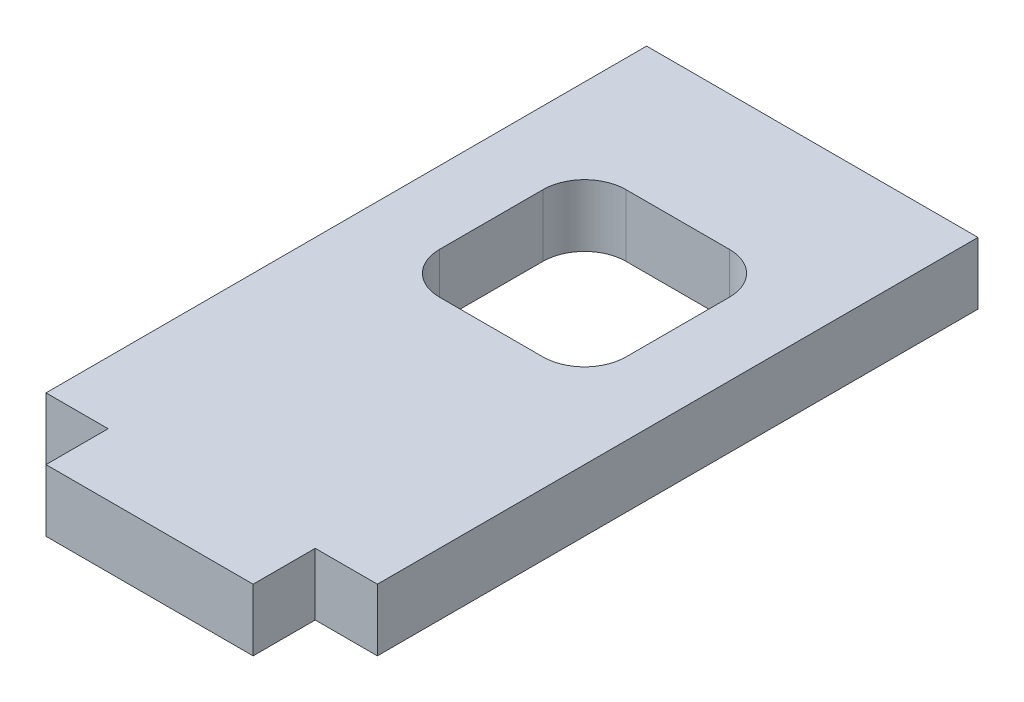
ISO-10303-21;
HEADER;
FILE_DESCRIPTION(('STEP AP214'),'2;1');
FILE_NAME('part.step','',(''),(''),'','','');
FILE_SCHEMA(('AUTOMOTIVE_DESIGN { 1 0 10303 214 1 1 1 1 }'));
ENDSEC;
DATA;
#1=APPLICATION_CONTEXT('core data for automotive mechanical design processes');
#2=APPLICATION_PROTOCOL_DEFINITION('international standard','automotive_design',2000,#1);
#3=PRODUCT_CONTEXT('',#1,'mechanical');
#4=PRODUCT('Part','Part','',(#3));
#5=PRODUCT_RELATED_PRODUCT_CATEGORY('part','',(#4));
#6=PRODUCT_DEFINITION_FORMATION('','',#4);
#7=PRODUCT_DEFINITION_CONTEXT('part definition',#1,'design');
#8=PRODUCT_DEFINITION('design','',#6,#7);
#9=PRODUCT_DEFINITION_SHAPE('','',#8);
#10=(LENGTH_UNIT() NAMED_UNIT(*) SI_UNIT(.MILLI.,.METRE.));
#11=(NAMED_UNIT(*) PLANE_ANGLE_UNIT() SI_UNIT($,.RADIAN.));
#12=(NAMED_UNIT(*) SI_UNIT($,.STERADIAN.) SOLID_ANGLE_UNIT());
#13=UNCERTAINTY_MEASURE_WITH_UNIT(LENGTH_MEASURE(1.E-05),#10,'distance_accuracy_value','');
#14=(GEOMETRIC_REPRESENTATION_CONTEXT(3) GLOBAL_UNCERTAINTY_ASSIGNED_CONTEXT((#13)) GLOBAL_UNIT_ASSIGNED_CONTEXT((#10,
#11,#12)) REPRESENTATION_CONTEXT('',''));
#15=CARTESIAN_POINT('',(0.,0.,0.));
#16=DIRECTION('',(0.,0.,1.));
#17=DIRECTION('',(1.,0.,0.));
#18=AXIS2_PLACEMENT_3D('',#15,#16,#17);
#19=CARTESIAN_POINT('',(-8.,1.5,14.5));
#20=DIRECTION('',(0.,0.,-1.));
#21=DIRECTION('',(-1.,0.,0.));
#22=AXIS2_PLACEMENT_3D('',#19,#20,#21);
#23=PLANE('',#22);
#24=DIRECTION('',(0.,-1.,0.));
#25=VECTOR('',#24,1.);
#26=CARTESIAN_POINT('',(-5.,1.5,14.5));
#27=LINE('',#26,#25);
#28=CARTESIAN_POINT('',(-5.,1.5,14.5));
#29=VERTEX_POINT('',#28);
#30=CARTESIAN_POINT('',(-5.,-1.5,14.5));
#31=VERTEX_POINT('',#30);
#32=EDGE_CURVE('E291',#29,#31,#27,.T.);
#33=ORIENTED_EDGE('',*,*,#32,.F.);
#34=DIRECTION('',(1.,0.,0.));
#35=VECTOR('',#34,1.);
#36=CARTESIAN_POINT('',(-8.,1.5,14.5));
#37=LINE('',#36,#35);
#38=CARTESIAN_POINT('',(-8.,1.5,14.5));
#39=VERTEX_POINT('',#38);
#40=EDGE_CURVE('E162',#39,#29,#37,.T.);
#41=ORIENTED_EDGE('',*,*,#40,.F.);
#42=DIRECTION('',(0.,-1.,0.));
#43=VECTOR('',#42,1.);
#44=CARTESIAN_POINT('',(-8.,1.5,14.5));
#45=LINE('',#44,#43);
#46=CARTESIAN_POINT('',(-8.,-1.5,14.5));
#47=VERTEX_POINT('',#46);
#48=EDGE_CURVE('E203',#39,#47,#45,.T.);
#49=ORIENTED_EDGE('',*,*,#48,.T.);
#50=DIRECTION('',(1.,0.,0.));
#51=VECTOR('',#50,1.);
#52=CARTESIAN_POINT('',(-8.,-1.5,14.5));
#53=LINE('',#52,#51);
#54=EDGE_CURVE('E189',#47,#31,#53,.T.);
#55=ORIENTED_EDGE('',*,*,#54,.T.);
#56=EDGE_LOOP('',(#33,#41,#49,#55));
#57=FACE_BOUND('',#56,.T.);
#58=ADVANCED_FACE('F33',(#57),#23,.F.);
#59=CARTESIAN_POINT('',(-8.,1.5,-14.5));
#60=DIRECTION('',(1.,0.,0.));
#61=DIRECTION('',(0.,0.,-1.));
#62=AXIS2_PLACEMENT_3D('',#59,#60,#61);
#63=PLANE('',#62);
#64=DIRECTION('',(0.,0.,1.));
#65=VECTOR('',#64,1.);
#66=CARTESIAN_POINT('',(-8.,-1.5,-14.5));
#67=LINE('',#66,#65);
#68=CARTESIAN_POINT('',(-8.,-1.5,-14.5));
#69=VERTEX_POINT('',#68);
#70=EDGE_CURVE('E170',#69,#47,#67,.T.);
#71=ORIENTED_EDGE('',*,*,#70,.T.);
#72=ORIENTED_EDGE('',*,*,#48,.F.);
#73=DIRECTION('',(0.,0.,1.));
#74=VECTOR('',#73,1.);
#75=CARTESIAN_POINT('',(-8.,1.5,-14.5));
#76=LINE('',#75,#74);
#77=CARTESIAN_POINT('',(-8.,1.5,-14.5));
#78=VERTEX_POINT('',#77);
#79=EDGE_CURVE('E179',#78,#39,#76,.T.);
#80=ORIENTED_EDGE('',*,*,#79,.F.);
#81=DIRECTION('',(0.,-1.,0.));
#82=VECTOR('',#81,1.);
#83=CARTESIAN_POINT('',(-8.,1.5,-14.5));
#84=LINE('',#83,#82);
#85=EDGE_CURVE('E187',#78,#69,#84,.T.);
#86=ORIENTED_EDGE('',*,*,#85,.T.);
#87=EDGE_LOOP('',(#71,#72,#80,#86));
#88=FACE_BOUND('',#87,.T.);
#89=ADVANCED_FACE('F265',(#88),#63,.F.);
#90=CARTESIAN_POINT('',(5.,1.5,14.5));
#91=VERTEX_POINT('',#90);
#92=CARTESIAN_POINT('',(8.,1.5,14.5));
#93=VERTEX_POINT('',#92);
#94=EDGE_CURVE('E181',#91,#93,#37,.T.);
#95=ORIENTED_EDGE('',*,*,#94,.F.);
#96=DIRECTION('',(0.,-1.,0.));
#97=VECTOR('',#96,1.);
#98=CARTESIAN_POINT('',(5.,1.5,14.5));
#99=LINE('',#98,#97);
#100=CARTESIAN_POINT('',(5.,-1.5,14.5));
#101=VERTEX_POINT('',#100);
#102=EDGE_CURVE('E175',#91,#101,#99,.T.);
#103=ORIENTED_EDGE('',*,*,#102,.T.);
#104=CARTESIAN_POINT('',(8.,-1.5,14.5));
#105=VERTEX_POINT('',#104);
#106=EDGE_CURVE('E173',#101,#105,#53,.T.);
#107=ORIENTED_EDGE('',*,*,#106,.T.);
#108=DIRECTION('',(0.,-1.,0.));
#109=VECTOR('',#108,1.);
#110=CARTESIAN_POINT('',(8.,1.5,14.5));
#111=LINE('',#110,#109);
#112=EDGE_CURVE('E200',#93,#105,#111,.T.);
#113=ORIENTED_EDGE('',*,*,#112,.F.);
#114=EDGE_LOOP('',(#95,#103,#107,#113));
#115=FACE_BOUND('',#114,.T.);
#116=ADVANCED_FACE('F268',(#115),#23,.F.);
#117=CARTESIAN_POINT('',(8.,1.5,-14.5));
#118=DIRECTION('',(-1.,0.,0.));
#119=DIRECTION('',(0.,0.,1.));
#120=AXIS2_PLACEMENT_3D('',#117,#118,#119);
#121=PLANE('',#120);
#122=DIRECTION('',(0.,0.,-1.));
#123=VECTOR('',#122,1.);
#124=CARTESIAN_POINT('',(8.,-1.5,-14.5));
#125=LINE('',#124,#123);
#126=CARTESIAN_POINT('',(8.,-1.5,-14.5));
#127=VERTEX_POINT('',#126);
#128=EDGE_CURVE('E192',#105,#127,#125,.T.);
#129=ORIENTED_EDGE('',*,*,#128,.T.);
#130=DIRECTION('',(0.,-1.,0.));
#131=VECTOR('',#130,1.);
#132=CARTESIAN_POINT('',(8.,1.5,-14.5));
#133=LINE('',#132,#131);
#134=CARTESIAN_POINT('',(8.,1.5,-14.5));
#135=VERTEX_POINT('',#134);
#136=EDGE_CURVE('E197',#135,#127,#133,.T.);
#137=ORIENTED_EDGE('',*,*,#136,.F.);
#138=DIRECTION('',(0.,0.,-1.));
#139=VECTOR('',#138,1.);
#140=CARTESIAN_POINT('',(8.,1.5,-14.5));
#141=LINE('',#140,#139);
#142=EDGE_CURVE('E184',#93,#135,#141,.T.);
#143=ORIENTED_EDGE('',*,*,#142,.F.);
#144=ORIENTED_EDGE('',*,*,#112,.T.);
#145=EDGE_LOOP('',(#129,#137,#143,#144));
#146=FACE_BOUND('',#145,.T.);
#147=ADVANCED_FACE('F276',(#146),#121,.F.);
#148=CARTESIAN_POINT('',(-8.,1.5,-14.5));
#149=DIRECTION('',(0.,0.,1.));
#150=DIRECTION('',(1.,0.,0.));
#151=AXIS2_PLACEMENT_3D('',#148,#149,#150);
#152=PLANE('',#151);
#153=DIRECTION('',(-1.,0.,0.));
#154=VECTOR('',#153,1.);
#155=CARTESIAN_POINT('',(-8.,-1.5,-14.5));
#156=LINE('',#155,#154);
#157=EDGE_CURVE('E182',#127,#69,#156,.T.);
#158=ORIENTED_EDGE('',*,*,#157,.T.);
#159=ORIENTED_EDGE('',*,*,#85,.F.);
#160=DIRECTION('',(-1.,0.,0.));
#161=VECTOR('',#160,1.);
#162=CARTESIAN_POINT('',(-8.,1.5,-14.5));
#163=LINE('',#162,#161);
#164=EDGE_CURVE('E186',#135,#78,#163,.T.);
#165=ORIENTED_EDGE('',*,*,#164,.F.);
#166=ORIENTED_EDGE('',*,*,#136,.T.);
#167=EDGE_LOOP('',(#158,#159,#165,#166));
#168=FACE_BOUND('',#167,.T.);
#169=ADVANCED_FACE('F281',(#168),#152,.F.);
#170=CARTESIAN_POINT('',(0.,1.5,0.));
#171=DIRECTION('',(0.,1.,0.));
#172=DIRECTION('',(0.,0.,1.));
#173=AXIS2_PLACEMENT_3D('',#170,#171,#172);
#174=PLANE('',#173);
#175=DIRECTION('',(0.,0.,1.));
#176=VECTOR('',#175,1.);
#177=CARTESIAN_POINT('',(-4.50000000000001,1.5,-8.));
#178=LINE('',#177,#176);
#179=CARTESIAN_POINT('',(-4.50000000000001,1.5,-6.));
#180=VERTEX_POINT('',#179);
#181=CARTESIAN_POINT('',(-4.50000000000001,1.5,-0.999999999999999));
#182=VERTEX_POINT('',#181);
#183=EDGE_CURVE('E314',#180,#182,#178,.T.);
#184=ORIENTED_EDGE('',*,*,#183,.F.);
#185=CARTESIAN_POINT('',(-2.50000000000001,1.5,-6.));
#186=DIRECTION('',(0.,1.,0.));
#187=DIRECTION('',(0.,0.,1.));
#188=AXIS2_PLACEMENT_3D('',#185,#186,#187);
#189=CIRCLE('',#188,2.);
#190=CARTESIAN_POINT('',(-2.50000000000001,1.5,-8.));
#191=VERTEX_POINT('',#190);
#192=EDGE_CURVE('E55',#180,#191,#189,.F.);
#193=ORIENTED_EDGE('',*,*,#192,.T.);
#194=DIRECTION('',(-1.,0.,0.));
#195=VECTOR('',#194,1.);
#196=CARTESIAN_POINT('',(-4.50000000000001,1.5,-8.));
#197=LINE('',#196,#195);
#198=CARTESIAN_POINT('',(2.49999999999999,1.5,-8.));
#199=VERTEX_POINT('',#198);
#200=EDGE_CURVE('E251',#199,#191,#197,.T.);
#201=ORIENTED_EDGE('',*,*,#200,.F.);
#202=CARTESIAN_POINT('',(2.49999999999999,1.5,-6.));
#203=DIRECTION('',(0.,1.,0.));
#204=DIRECTION('',(0.,0.,1.));
#205=AXIS2_PLACEMENT_3D('',#202,#203,#204);
#206=CIRCLE('',#205,2.);
#207=CARTESIAN_POINT('',(4.49999999999999,1.5,-6.));
#208=VERTEX_POINT('',#207);
#209=EDGE_CURVE('E229',#199,#208,#206,.F.);
#210=ORIENTED_EDGE('',*,*,#209,.T.);
#211=DIRECTION('',(0.,0.,-1.));
#212=VECTOR('',#211,1.);
#213=CARTESIAN_POINT('',(4.49999999999999,1.5,-8.));
#214=LINE('',#213,#212);
#215=CARTESIAN_POINT('',(4.50000000000001,1.5,-1.));
#216=VERTEX_POINT('',#215);
#217=EDGE_CURVE('E308',#216,#208,#214,.T.);
#218=ORIENTED_EDGE('',*,*,#217,.F.);
#219=CARTESIAN_POINT('',(2.50000000000001,1.5,-0.999999999999999));
#220=DIRECTION('',(0.,1.,0.));
#221=DIRECTION('',(0.,0.,1.));
#222=AXIS2_PLACEMENT_3D('',#219,#220,#221);
#223=CIRCLE('',#222,2.);
#224=CARTESIAN_POINT('',(2.50000000000001,1.5,1.));
#225=VERTEX_POINT('',#224);
#226=EDGE_CURVE('E225',#216,#225,#223,.F.);
#227=ORIENTED_EDGE('',*,*,#226,.T.);
#228=DIRECTION('',(1.,0.,0.));
#229=VECTOR('',#228,1.);
#230=CARTESIAN_POINT('',(-4.50000000000001,1.5,1.));
#231=LINE('',#230,#229);
#232=CARTESIAN_POINT('',(-2.50000000000001,1.5,1.));
#233=VERTEX_POINT('',#232);
#234=EDGE_CURVE('E311',#233,#225,#231,.T.);
#235=ORIENTED_EDGE('',*,*,#234,.F.);
#236=CARTESIAN_POINT('',(-2.50000000000001,1.5,-0.999999999999999));
#237=DIRECTION('',(0.,1.,0.));
#238=DIRECTION('',(0.,0.,1.));
#239=AXIS2_PLACEMENT_3D('',#236,#237,#238);
#240=CIRCLE('',#239,2.);
#241=EDGE_CURVE('E41',#233,#182,#240,.F.);
#242=ORIENTED_EDGE('',*,*,#241,.T.);
#243=EDGE_LOOP('',(#184,#193,#201,#210,#218,#227,#235,#242));
#244=FACE_BOUND('',#243,.T.);
#245=ORIENTED_EDGE('',*,*,#79,.T.);
#246=ORIENTED_EDGE('',*,*,#40,.T.);
#247=DIRECTION('',(0.,0.,1.));
#248=VECTOR('',#247,1.);
#249=CARTESIAN_POINT('',(-5.,1.5,14.5));
#250=LINE('',#249,#248);
#251=CARTESIAN_POINT('',(-5.,1.5,17.5));
#252=VERTEX_POINT('',#251);
#253=EDGE_CURVE('E157',#29,#252,#250,.T.);
#254=ORIENTED_EDGE('',*,*,#253,.T.);
#255=DIRECTION('',(1.,0.,0.));
#256=VECTOR('',#255,1.);
#257=CARTESIAN_POINT('',(-5.,1.5,17.5));
#258=LINE('',#257,#256);
#259=CARTESIAN_POINT('',(5.,1.5,17.5));
#260=VERTEX_POINT('',#259);
#261=EDGE_CURVE('E146',#252,#260,#258,.T.);
#262=ORIENTED_EDGE('',*,*,#261,.T.);
#263=DIRECTION('',(0.,0.,-1.));
#264=VECTOR('',#263,1.);
#265=CARTESIAN_POINT('',(5.,1.5,14.5));
#266=LINE('',#265,#264);
#267=EDGE_CURVE('E156',#260,#91,#266,.T.);
#268=ORIENTED_EDGE('',*,*,#267,.T.);
#269=ORIENTED_EDGE('',*,*,#94,.T.);
#270=ORIENTED_EDGE('',*,*,#142,.T.);
#271=ORIENTED_EDGE('',*,*,#164,.T.);
#272=EDGE_LOOP('',(#245,#246,#254,#262,#268,#269,#270,#271));
#273=FACE_BOUND('',#272,.T.);
#274=ADVANCED_FACE('F161',(#244,#273),#174,.T.);
#275=CARTESIAN_POINT('',(0.,-1.5,0.));
#276=DIRECTION('',(0.,1.,0.));
#277=DIRECTION('',(0.,0.,1.));
#278=AXIS2_PLACEMENT_3D('',#275,#276,#277);
#279=PLANE('',#278);
#280=DIRECTION('',(0.,0.,-1.));
#281=VECTOR('',#280,1.);
#282=CARTESIAN_POINT('',(4.49999999999999,-1.5,-8.));
#283=LINE('',#282,#281);
#284=CARTESIAN_POINT('',(4.50000000000001,-1.5,-1.));
#285=VERTEX_POINT('',#284);
#286=CARTESIAN_POINT('',(4.49999999999999,-1.5,-6.));
#287=VERTEX_POINT('',#286);
#288=EDGE_CURVE('E302',#285,#287,#283,.T.);
#289=ORIENTED_EDGE('',*,*,#288,.T.);
#290=CARTESIAN_POINT('',(2.49999999999999,-1.5,-6.));
#291=DIRECTION('',(0.,1.,0.));
#292=DIRECTION('',(0.,0.,1.));
#293=AXIS2_PLACEMENT_3D('',#290,#291,#292);
#294=CIRCLE('',#293,2.);
#295=CARTESIAN_POINT('',(2.49999999999999,-1.5,-8.));
#296=VERTEX_POINT('',#295);
#297=EDGE_CURVE('E231',#287,#296,#294,.T.);
#298=ORIENTED_EDGE('',*,*,#297,.T.);
#299=DIRECTION('',(-1.,0.,0.));
#300=VECTOR('',#299,1.);
#301=CARTESIAN_POINT('',(-4.50000000000001,-1.5,-8.));
#302=LINE('',#301,#300);
#303=CARTESIAN_POINT('',(-2.50000000000001,-1.5,-8.));
#304=VERTEX_POINT('',#303);
#305=EDGE_CURVE('E246',#296,#304,#302,.T.);
#306=ORIENTED_EDGE('',*,*,#305,.T.);
#307=CARTESIAN_POINT('',(-2.50000000000001,-1.5,-6.));
#308=DIRECTION('',(0.,1.,0.));
#309=DIRECTION('',(0.,0.,1.));
#310=AXIS2_PLACEMENT_3D('',#307,#308,#309);
#311=CIRCLE('',#310,2.);
#312=CARTESIAN_POINT('',(-4.50000000000001,-1.5,-6.));
#313=VERTEX_POINT('',#312);
#314=EDGE_CURVE('E234',#304,#313,#311,.T.);
#315=ORIENTED_EDGE('',*,*,#314,.T.);
#316=DIRECTION('',(0.,0.,1.));
#317=VECTOR('',#316,1.);
#318=CARTESIAN_POINT('',(-4.50000000000001,-1.5,-8.));
#319=LINE('',#318,#317);
#320=CARTESIAN_POINT('',(-4.50000000000001,-1.5,-0.999999999999999));
#321=VERTEX_POINT('',#320);
#322=EDGE_CURVE('E243',#313,#321,#319,.T.);
#323=ORIENTED_EDGE('',*,*,#322,.T.);
#324=CARTESIAN_POINT('',(-2.50000000000001,-1.5,-0.999999999999999));
#325=DIRECTION('',(0.,1.,0.));
#326=DIRECTION('',(0.,0.,1.));
#327=AXIS2_PLACEMENT_3D('',#324,#325,#326);
#328=CIRCLE('',#327,2.);
#329=CARTESIAN_POINT('',(-2.50000000000001,-1.5,1.));
#330=VERTEX_POINT('',#329);
#331=EDGE_CURVE('E11',#321,#330,#328,.T.);
#332=ORIENTED_EDGE('',*,*,#331,.T.);
#333=DIRECTION('',(1.,0.,0.));
#334=VECTOR('',#333,1.);
#335=CARTESIAN_POINT('',(-4.50000000000001,-1.5,1.));
#336=LINE('',#335,#334);
#337=CARTESIAN_POINT('',(2.50000000000001,-1.5,1.));
#338=VERTEX_POINT('',#337);
#339=EDGE_CURVE('E250',#330,#338,#336,.T.);
#340=ORIENTED_EDGE('',*,*,#339,.T.);
#341=CARTESIAN_POINT('',(2.50000000000001,-1.5,-0.999999999999999));
#342=DIRECTION('',(0.,1.,0.));
#343=DIRECTION('',(0.,0.,1.));
#344=AXIS2_PLACEMENT_3D('',#341,#342,#343);
#345=CIRCLE('',#344,2.);
#346=EDGE_CURVE('E227',#338,#285,#345,.T.);
#347=ORIENTED_EDGE('',*,*,#346,.T.);
#348=EDGE_LOOP('',(#289,#298,#306,#315,#323,#332,#340,#347));
#349=FACE_BOUND('',#348,.T.);
#350=ORIENTED_EDGE('',*,*,#70,.F.);
#351=ORIENTED_EDGE('',*,*,#157,.F.);
#352=ORIENTED_EDGE('',*,*,#128,.F.);
#353=ORIENTED_EDGE('',*,*,#106,.F.);
#354=DIRECTION('',(0.,0.,-1.));
#355=VECTOR('',#354,1.);
#356=CARTESIAN_POINT('',(5.,-1.5,14.5));
#357=LINE('',#356,#355);
#358=CARTESIAN_POINT('',(5.,-1.5,17.5));
#359=VERTEX_POINT('',#358);
#360=EDGE_CURVE('E165',#359,#101,#357,.T.);
#361=ORIENTED_EDGE('',*,*,#360,.F.);
#362=DIRECTION('',(1.,0.,0.));
#363=VECTOR('',#362,1.);
#364=CARTESIAN_POINT('',(-5.,-1.5,17.5));
#365=LINE('',#364,#363);
#366=CARTESIAN_POINT('',(-5.,-1.5,17.5));
#367=VERTEX_POINT('',#366);
#368=EDGE_CURVE('E298',#367,#359,#365,.T.);
#369=ORIENTED_EDGE('',*,*,#368,.F.);
#370=DIRECTION('',(0.,0.,1.));
#371=VECTOR('',#370,1.);
#372=CARTESIAN_POINT('',(-5.,-1.5,14.5));
#373=LINE('',#372,#371);
#374=EDGE_CURVE('E169',#31,#367,#373,.T.);
#375=ORIENTED_EDGE('',*,*,#374,.F.);
#376=ORIENTED_EDGE('',*,*,#54,.F.);
#377=EDGE_LOOP('',(#350,#351,#352,#353,#361,#369,#375,#376));
#378=FACE_BOUND('',#377,.T.);
#379=ADVANCED_FACE('F241',(#349,#378),#279,.F.);
#380=CARTESIAN_POINT('',(-5.,1.5,14.5));
#381=DIRECTION('',(1.,0.,0.));
#382=DIRECTION('',(0.,0.,-1.));
#383=AXIS2_PLACEMENT_3D('',#380,#381,#382);
#384=PLANE('',#383);
#385=ORIENTED_EDGE('',*,*,#374,.T.);
#386=DIRECTION('',(0.,-1.,0.));
#387=VECTOR('',#386,1.);
#388=CARTESIAN_POINT('',(-5.,1.5,17.5));
#389=LINE('',#388,#387);
#390=EDGE_CURVE('E150',#252,#367,#389,.T.);
#391=ORIENTED_EDGE('',*,*,#390,.F.);
#392=ORIENTED_EDGE('',*,*,#253,.F.);
#393=ORIENTED_EDGE('',*,*,#32,.T.);
#394=EDGE_LOOP('',(#385,#391,#392,#393));
#395=FACE_BOUND('',#394,.T.);
#396=ADVANCED_FACE('F167',(#395),#384,.F.);
#397=CARTESIAN_POINT('',(-5.,1.5,17.5));
#398=DIRECTION('',(0.,0.,-1.));
#399=DIRECTION('',(-1.,0.,0.));
#400=AXIS2_PLACEMENT_3D('',#397,#398,#399);
#401=PLANE('',#400);
#402=ORIENTED_EDGE('',*,*,#368,.T.);
#403=DIRECTION('',(0.,-1.,0.));
#404=VECTOR('',#403,1.);
#405=CARTESIAN_POINT('',(5.,1.5,17.5));
#406=LINE('',#405,#404);
#407=EDGE_CURVE('E153',#260,#359,#406,.T.);
#408=ORIENTED_EDGE('',*,*,#407,.F.);
#409=ORIENTED_EDGE('',*,*,#261,.F.);
#410=ORIENTED_EDGE('',*,*,#390,.T.);
#411=EDGE_LOOP('',(#402,#408,#409,#410));
#412=FACE_BOUND('',#411,.T.);
#413=ADVANCED_FACE('F148',(#412),#401,.F.);
#414=CARTESIAN_POINT('',(5.,1.5,14.5));
#415=DIRECTION('',(-1.,0.,0.));
#416=DIRECTION('',(0.,0.,1.));
#417=AXIS2_PLACEMENT_3D('',#414,#415,#416);
#418=PLANE('',#417);
#419=ORIENTED_EDGE('',*,*,#360,.T.);
#420=ORIENTED_EDGE('',*,*,#102,.F.);
#421=ORIENTED_EDGE('',*,*,#267,.F.);
#422=ORIENTED_EDGE('',*,*,#407,.T.);
#423=EDGE_LOOP('',(#419,#420,#421,#422));
#424=FACE_BOUND('',#423,.T.);
#425=ADVANCED_FACE('F293',(#424),#418,.F.);
#426=CARTESIAN_POINT('',(-4.50000000000001,-1.5,-8.));
#427=DIRECTION('',(-1.,0.,0.));
#428=DIRECTION('',(0.,0.,1.));
#429=AXIS2_PLACEMENT_3D('',#426,#427,#428);
#430=PLANE('',#429);
#431=ORIENTED_EDGE('',*,*,#322,.F.);
#432=DIRECTION('',(0.,1.,0.));
#433=VECTOR('',#432,1.);
#434=CARTESIAN_POINT('',(-4.50000000000001,1.5,-6.));
#435=LINE('',#434,#433);
#436=EDGE_CURVE('E223',#313,#180,#435,.T.);
#437=ORIENTED_EDGE('',*,*,#436,.T.);
#438=ORIENTED_EDGE('',*,*,#183,.T.);
#439=DIRECTION('',(0.,1.,0.));
#440=VECTOR('',#439,1.);
#441=CARTESIAN_POINT('',(-4.50000000000001,-1.5,-0.999999999999999));
#442=LINE('',#441,#440);
#443=EDGE_CURVE('E221',#182,#321,#442,.F.);
#444=ORIENTED_EDGE('',*,*,#443,.T.);
#445=EDGE_LOOP('',(#431,#437,#438,#444));
#446=FACE_BOUND('',#445,.T.);
#447=ADVANCED_FACE('F248',(#446),#430,.F.);
#448=CARTESIAN_POINT('',(-4.50000000000001,-1.5,-8.));
#449=DIRECTION('',(0.,0.,-1.));
#450=DIRECTION('',(-1.,0.,0.));
#451=AXIS2_PLACEMENT_3D('',#448,#449,#450);
#452=PLANE('',#451);
#453=ORIENTED_EDGE('',*,*,#305,.F.);
#454=DIRECTION('',(0.,1.,0.));
#455=VECTOR('',#454,1.);
#456=CARTESIAN_POINT('',(2.49999999999999,1.5,-8.));
#457=LINE('',#456,#455);
#458=EDGE_CURVE('E218',#296,#199,#457,.T.);
#459=ORIENTED_EDGE('',*,*,#458,.T.);
#460=ORIENTED_EDGE('',*,*,#200,.T.);
#461=DIRECTION('',(0.,1.,0.));
#462=VECTOR('',#461,1.);
#463=CARTESIAN_POINT('',(-2.50000000000001,-1.5,-8.));
#464=LINE('',#463,#462);
#465=EDGE_CURVE('E216',#191,#304,#464,.F.);
#466=ORIENTED_EDGE('',*,*,#465,.T.);
#467=EDGE_LOOP('',(#453,#459,#460,#466));
#468=FACE_BOUND('',#467,.T.);
#469=ADVANCED_FACE('F331',(#468),#452,.F.);
#470=CARTESIAN_POINT('',(4.49999999999999,-1.5,-8.));
#471=DIRECTION('',(1.,0.,0.));
#472=DIRECTION('',(0.,0.,-1.));
#473=AXIS2_PLACEMENT_3D('',#470,#471,#472);
#474=PLANE('',#473);
#475=ORIENTED_EDGE('',*,*,#288,.F.);
#476=DIRECTION('',(0.,1.,0.));
#477=VECTOR('',#476,1.);
#478=CARTESIAN_POINT('',(4.50000000000001,1.5,-1.));
#479=LINE('',#478,#477);
#480=EDGE_CURVE('E208',#285,#216,#479,.T.);
#481=ORIENTED_EDGE('',*,*,#480,.T.);
#482=ORIENTED_EDGE('',*,*,#217,.T.);
#483=DIRECTION('',(0.,1.,0.));
#484=VECTOR('',#483,1.);
#485=CARTESIAN_POINT('',(4.49999999999999,-1.5,-6.));
#486=LINE('',#485,#484);
#487=EDGE_CURVE('E206',#208,#287,#486,.F.);
#488=ORIENTED_EDGE('',*,*,#487,.T.);
#489=EDGE_LOOP('',(#475,#481,#482,#488));
#490=FACE_BOUND('',#489,.T.);
#491=ADVANCED_FACE('F326',(#490),#474,.F.);
#492=CARTESIAN_POINT('',(-4.50000000000001,-1.5,1.));
#493=DIRECTION('',(0.,0.,1.));
#494=DIRECTION('',(1.,0.,0.));
#495=AXIS2_PLACEMENT_3D('',#492,#493,#494);
#496=PLANE('',#495);
#497=ORIENTED_EDGE('',*,*,#234,.T.);
#498=DIRECTION('',(0.,1.,0.));
#499=VECTOR('',#498,1.);
#500=CARTESIAN_POINT('',(2.50000000000001,-1.5,1.));
#501=LINE('',#500,#499);
#502=EDGE_CURVE('E214',#225,#338,#501,.F.);
#503=ORIENTED_EDGE('',*,*,#502,.T.);
#504=ORIENTED_EDGE('',*,*,#339,.F.);
#505=DIRECTION('',(0.,1.,0.));
#506=VECTOR('',#505,1.);
#507=CARTESIAN_POINT('',(-2.50000000000001,1.5,1.));
#508=LINE('',#507,#506);
#509=EDGE_CURVE('E211',#330,#233,#508,.T.);
#510=ORIENTED_EDGE('',*,*,#509,.T.);
#511=EDGE_LOOP('',(#497,#503,#504,#510));
#512=FACE_BOUND('',#511,.T.);
#513=ADVANCED_FACE('F319',(#512),#496,.F.);
#514=CARTESIAN_POINT('',(2.50000000000001,-1.5,-0.999999999999999));
#515=DIRECTION('',(0.,-1.,0.));
#516=DIRECTION('',(0.,0.,-1.));
#517=AXIS2_PLACEMENT_3D('',#514,#515,#516);
#518=CYLINDRICAL_SURFACE('',#517,2.);
#519=ORIENTED_EDGE('',*,*,#346,.F.);
#520=ORIENTED_EDGE('',*,*,#502,.F.);
#521=ORIENTED_EDGE('',*,*,#226,.F.);
#522=ORIENTED_EDGE('',*,*,#480,.F.);
#523=EDGE_LOOP('',(#519,#520,#521,#522));
#524=FACE_BOUND('',#523,.T.);
#525=ADVANCED_FACE('F261',(#524),#518,.F.);
#526=CARTESIAN_POINT('',(2.49999999999999,-1.5,-6.));
#527=DIRECTION('',(0.,-1.,0.));
#528=DIRECTION('',(0.,0.,-1.));
#529=AXIS2_PLACEMENT_3D('',#526,#527,#528);
#530=CYLINDRICAL_SURFACE('',#529,2.);
#531=ORIENTED_EDGE('',*,*,#297,.F.);
#532=ORIENTED_EDGE('',*,*,#487,.F.);
#533=ORIENTED_EDGE('',*,*,#209,.F.);
#534=ORIENTED_EDGE('',*,*,#458,.F.);
#535=EDGE_LOOP('',(#531,#532,#533,#534));
#536=FACE_BOUND('',#535,.T.);
#537=ADVANCED_FACE('F255',(#536),#530,.F.);
#538=CARTESIAN_POINT('',(-2.50000000000001,-1.5,-6.));
#539=DIRECTION('',(0.,-1.,0.));
#540=DIRECTION('',(0.,0.,-1.));
#541=AXIS2_PLACEMENT_3D('',#538,#539,#540);
#542=CYLINDRICAL_SURFACE('',#541,2.);
#543=ORIENTED_EDGE('',*,*,#314,.F.);
#544=ORIENTED_EDGE('',*,*,#465,.F.);
#545=ORIENTED_EDGE('',*,*,#192,.F.);
#546=ORIENTED_EDGE('',*,*,#436,.F.);
#547=EDGE_LOOP('',(#543,#544,#545,#546));
#548=FACE_BOUND('',#547,.T.);
#549=ADVANCED_FACE('F253',(#548),#542,.F.);
#550=CARTESIAN_POINT('',(-2.50000000000001,-1.5,-0.999999999999999));
#551=DIRECTION('',(0.,-1.,0.));
#552=DIRECTION('',(0.,0.,-1.));
#553=AXIS2_PLACEMENT_3D('',#550,#551,#552);
#554=CYLINDRICAL_SURFACE('',#553,2.);
#555=ORIENTED_EDGE('',*,*,#331,.F.);
#556=ORIENTED_EDGE('',*,*,#443,.F.);
#557=ORIENTED_EDGE('',*,*,#241,.F.);
#558=ORIENTED_EDGE('',*,*,#509,.F.);
#559=EDGE_LOOP('',(#555,#556,#557,#558));
#560=FACE_BOUND('',#559,.T.);
#561=ADVANCED_FACE('F35',(#560),#554,.F.);
#562=CLOSED_SHELL('',(#58,#89,#116,#147,#169,#274,#379,#396,#413,#425,#447,#469,#491,#513,#525,
#537,#549,#561));
#563=MANIFOLD_SOLID_BREP('B2',#562);
#564=ADVANCED_BREP_SHAPE_REPRESENTATION('',(#18,#563),#14);
#565=SHAPE_DEFINITION_REPRESENTATION(#9,#564);
ENDSEC;
END-ISO-10303-21;
